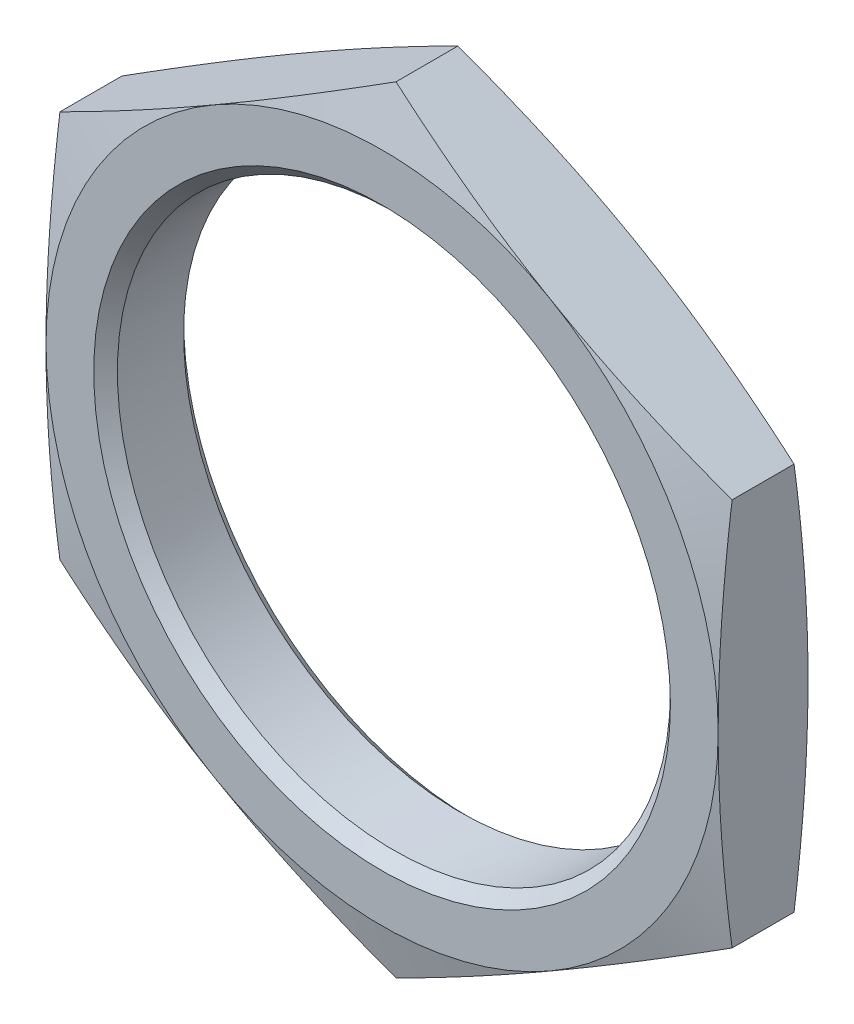
ISO-10303-21;
HEADER;
FILE_DESCRIPTION(('STEP AP214'),'2;1');
FILE_NAME('part.step','',(''),(''),'','','');
FILE_SCHEMA(('AUTOMOTIVE_DESIGN { 1 0 10303 214 1 1 1 1 }'));
ENDSEC;
DATA;
#1=APPLICATION_CONTEXT('core data for automotive mechanical design processes');
#2=APPLICATION_PROTOCOL_DEFINITION('international standard','automotive_design',2000,#1);
#3=PRODUCT_CONTEXT('',#1,'mechanical');
#4=PRODUCT('Part','Part','',(#3));
#5=PRODUCT_RELATED_PRODUCT_CATEGORY('part','',(#4));
#6=PRODUCT_DEFINITION_FORMATION('','',#4);
#7=PRODUCT_DEFINITION_CONTEXT('part definition',#1,'design');
#8=PRODUCT_DEFINITION('design','',#6,#7);
#9=PRODUCT_DEFINITION_SHAPE('','',#8);
#10=(LENGTH_UNIT() NAMED_UNIT(*) SI_UNIT(.MILLI.,.METRE.));
#11=(NAMED_UNIT(*) PLANE_ANGLE_UNIT() SI_UNIT($,.RADIAN.));
#12=(NAMED_UNIT(*) SI_UNIT($,.STERADIAN.) SOLID_ANGLE_UNIT());
#13=UNCERTAINTY_MEASURE_WITH_UNIT(LENGTH_MEASURE(1.E-05),#10,'distance_accuracy_value','');
#14=(GEOMETRIC_REPRESENTATION_CONTEXT(3) GLOBAL_UNCERTAINTY_ASSIGNED_CONTEXT((#13)) GLOBAL_UNIT_ASSIGNED_CONTEXT((#10,
#11,#12)) REPRESENTATION_CONTEXT('',''));
#15=CARTESIAN_POINT('',(0.,0.,0.));
#16=DIRECTION('',(0.,0.,1.));
#17=DIRECTION('',(1.,0.,0.));
#18=AXIS2_PLACEMENT_3D('',#15,#16,#17);
#19=CARTESIAN_POINT('',(0.,0.,-0.95));
#20=DIRECTION('',(0.,0.,-1.));
#21=DIRECTION('',(0.,-1.,0.));
#22=AXIS2_PLACEMENT_3D('',#19,#20,#21);
#23=PLANE('',#22);
#24=CARTESIAN_POINT('',(0.,0.,-0.95));
#25=DIRECTION('',(0.,0.,-1.));
#26=DIRECTION('',(1.,0.,0.));
#27=AXIS2_PLACEMENT_3D('',#24,#25,#26);
#28=CIRCLE('',#27,7.11);
#29=CARTESIAN_POINT('',(7.11,0.,-0.95));
#30=VERTEX_POINT('',#29);
#31=CARTESIAN_POINT('',(3.555,-6.157440620907,-0.95));
#32=VERTEX_POINT('',#31);
#33=EDGE_CURVE('E390',#30,#32,#28,.T.);
#34=ORIENTED_EDGE('',*,*,#33,.T.);
#35=CARTESIAN_POINT('',(0.,0.,-0.95));
#36=DIRECTION('',(0.,0.,-1.));
#37=DIRECTION('',(1.,0.,0.));
#38=AXIS2_PLACEMENT_3D('',#35,#36,#37);
#39=CIRCLE('',#38,7.11);
#40=CARTESIAN_POINT('',(-3.555,-6.157440620907,-0.95));
#41=VERTEX_POINT('',#40);
#42=EDGE_CURVE('E394',#32,#41,#39,.T.);
#43=ORIENTED_EDGE('',*,*,#42,.T.);
#44=CARTESIAN_POINT('',(0.,0.,-0.95));
#45=DIRECTION('',(0.,0.,-1.));
#46=DIRECTION('',(1.,0.,0.));
#47=AXIS2_PLACEMENT_3D('',#44,#45,#46);
#48=CIRCLE('',#47,7.11);
#49=CARTESIAN_POINT('',(-7.11,2.064765472972E-07,-0.95));
#50=VERTEX_POINT('',#49);
#51=EDGE_CURVE('E398',#41,#50,#48,.T.);
#52=ORIENTED_EDGE('',*,*,#51,.T.);
#53=CARTESIAN_POINT('',(0.,0.,-0.95));
#54=DIRECTION('',(0.,0.,-1.));
#55=DIRECTION('',(1.,0.,0.));
#56=AXIS2_PLACEMENT_3D('',#53,#54,#55);
#57=CIRCLE('',#56,7.11);
#58=CARTESIAN_POINT('',(-3.555,6.157440620907,-0.95));
#59=VERTEX_POINT('',#58);
#60=EDGE_CURVE('E25',#50,#59,#57,.T.);
#61=ORIENTED_EDGE('',*,*,#60,.T.);
#62=CARTESIAN_POINT('',(0.,0.,-0.95));
#63=DIRECTION('',(0.,0.,-1.));
#64=DIRECTION('',(1.,0.,0.));
#65=AXIS2_PLACEMENT_3D('',#62,#63,#64);
#66=CIRCLE('',#65,7.11);
#67=CARTESIAN_POINT('',(3.555,6.157440620907,-0.95));
#68=VERTEX_POINT('',#67);
#69=EDGE_CURVE('E11',#59,#68,#66,.T.);
#70=ORIENTED_EDGE('',*,*,#69,.T.);
#71=CARTESIAN_POINT('',(0.,0.,-0.95));
#72=DIRECTION('',(0.,0.,-1.));
#73=DIRECTION('',(1.,0.,0.));
#74=AXIS2_PLACEMENT_3D('',#71,#72,#73);
#75=CIRCLE('',#74,7.11);
#76=EDGE_CURVE('E387',#68,#30,#75,.T.);
#77=ORIENTED_EDGE('',*,*,#76,.T.);
#78=EDGE_LOOP('',(#34,#43,#52,#61,#70,#77));
#79=FACE_BOUND('',#78,.T.);
#80=CARTESIAN_POINT('',(0.,0.,-0.95));
#81=DIRECTION('',(0.,0.,-1.));
#82=DIRECTION('',(1.,0.,0.));
#83=AXIS2_PLACEMENT_3D('',#80,#81,#82);
#84=CIRCLE('',#83,6.1);
#85=CARTESIAN_POINT('',(6.1,0.,-0.95));
#86=VERTEX_POINT('',#85);
#87=EDGE_CURVE('E200',#86,#86,#84,.T.);
#88=ORIENTED_EDGE('',*,*,#87,.F.);
#89=EDGE_LOOP('',(#88));
#90=FACE_BOUND('',#89,.T.);
#91=ADVANCED_FACE('F17',(#79,#90),#23,.T.);
#92=CARTESIAN_POINT('',(0.,0.,0.));
#93=DIRECTION('',(0.,0.,1.));
#94=DIRECTION('',(1.,0.,0.));
#95=AXIS2_PLACEMENT_3D('',#92,#93,#94);
#96=CONICAL_SURFACE('',#95,10.655448267188,1.308996938996);
#97=CARTESIAN_POINT('',(5.95523630408934E-13,8.20992082787682,-0.655277102432029));
#98=CARTESIAN_POINT('',(1.90511875818563,7.10999999999992,-0.95));
#99=CARTESIAN_POINT('',(3.555,6.157440620907,-0.95));
#100=(BOUNDED_CURVE() B_SPLINE_CURVE(2,(#97,#98,#99),.UNSPECIFIED.,.F.,
.F.) B_SPLINE_CURVE_WITH_KNOTS((3,3),(0.,1.),
.UNSPECIFIED.) CURVE() GEOMETRIC_REPRESENTATION_ITEM() RATIONAL_B_SPLINE_CURVE((1.,
1.03795484930204,1.)) REPRESENTATION_ITEM(''));
#101=CARTESIAN_POINT('',(0.,8.209920827876,-0.655277102432));
#102=VERTEX_POINT('',#101);
#103=EDGE_CURVE('E373',#102,#68,#100,.T.);
#104=ORIENTED_EDGE('',*,*,#103,.T.);
#105=ORIENTED_EDGE('',*,*,#69,.F.);
#106=CARTESIAN_POINT('',(-3.555,6.157440620907,-0.95));
#107=CARTESIAN_POINT('',(-1.90511875818559,7.10999999999995,-0.95));
#108=CARTESIAN_POINT('',(-4.72066830070617E-13,8.20992082787689,-0.655277102432009));
#109=(BOUNDED_CURVE() B_SPLINE_CURVE(2,(#106,#107,#108),.UNSPECIFIED.,.F.,
.F.) B_SPLINE_CURVE_WITH_KNOTS((3,3),(0.,1.),
.UNSPECIFIED.) CURVE() GEOMETRIC_REPRESENTATION_ITEM() RATIONAL_B_SPLINE_CURVE((1.,
1.03795484930205,1.)) REPRESENTATION_ITEM(''));
#110=EDGE_CURVE('E315',#59,#102,#109,.T.);
#111=ORIENTED_EDGE('',*,*,#110,.T.);
#112=EDGE_LOOP('',(#104,#105,#111));
#113=FACE_BOUND('',#112,.T.);
#114=ADVANCED_FACE('F414',(#113),#96,.T.);
#115=CARTESIAN_POINT('',(0.,0.,0.));
#116=DIRECTION('',(0.,0.,1.));
#117=DIRECTION('',(1.,0.,0.));
#118=AXIS2_PLACEMENT_3D('',#115,#116,#117);
#119=CONICAL_SURFACE('',#118,10.655448267188,1.308996938996);
#120=CARTESIAN_POINT('',(-7.10999999999942,4.10496041393718,-0.655277102432026));
#121=CARTESIAN_POINT('',(-5.20488124181438,5.20488124181408,-0.950000000000001));
#122=CARTESIAN_POINT('',(-3.555,6.157440620907,-0.95));
#123=(BOUNDED_CURVE() B_SPLINE_CURVE(2,(#120,#121,#122),.UNSPECIFIED.,.F.,
.F.) B_SPLINE_CURVE_WITH_KNOTS((3,3),(0.,1.),
.UNSPECIFIED.) CURVE() GEOMETRIC_REPRESENTATION_ITEM() RATIONAL_B_SPLINE_CURVE((1.,
1.03795484930208,1.)) REPRESENTATION_ITEM(''));
#124=CARTESIAN_POINT('',(-7.11,4.104960413938,-0.655277102432));
#125=VERTEX_POINT('',#124);
#126=EDGE_CURVE('E356',#125,#59,#123,.T.);
#127=ORIENTED_EDGE('',*,*,#126,.T.);
#128=ORIENTED_EDGE('',*,*,#60,.F.);
#129=CARTESIAN_POINT('',(-7.11,2.06476544360344E-07,-0.95));
#130=CARTESIAN_POINT('',(-7.11,1.90511886883588,-0.949999985175651));
#131=CARTESIAN_POINT('',(-7.11,4.10496041393862,-0.655277102432165));
#132=(BOUNDED_CURVE() B_SPLINE_CURVE(2,(#129,#130,#131),.UNSPECIFIED.,.F.,
.F.) B_SPLINE_CURVE_WITH_KNOTS((3,3),(0.,1.),
.UNSPECIFIED.) CURVE() GEOMETRIC_REPRESENTATION_ITEM() RATIONAL_B_SPLINE_CURVE((1.,
1.03795484526372,1.)) REPRESENTATION_ITEM(''));
#133=EDGE_CURVE('E350',#50,#125,#132,.T.);
#134=ORIENTED_EDGE('',*,*,#133,.T.);
#135=EDGE_LOOP('',(#127,#128,#134));
#136=FACE_BOUND('',#135,.T.);
#137=ADVANCED_FACE('F408',(#136),#119,.T.);
#138=CARTESIAN_POINT('',(0.,0.,0.));
#139=DIRECTION('',(0.,0.,1.));
#140=DIRECTION('',(1.,0.,0.));
#141=AXIS2_PLACEMENT_3D('',#138,#139,#140);
#142=CONICAL_SURFACE('',#141,10.655448267188,1.308996938996);
#143=ORIENTED_EDGE('',*,*,#51,.F.);
#144=CARTESIAN_POINT('',(-3.555,-6.157440620907,-0.95));
#145=CARTESIAN_POINT('',(-5.20488124181442,-5.20488124181405,-0.950000000000001));
#146=CARTESIAN_POINT('',(-7.10999999999953,-4.10496041393711,-0.655277102432009));
#147=(BOUNDED_CURVE() B_SPLINE_CURVE(2,(#144,#145,#146),.UNSPECIFIED.,.F.,
.F.) B_SPLINE_CURVE_WITH_KNOTS((3,3),(0.,1.),
.UNSPECIFIED.) CURVE() GEOMETRIC_REPRESENTATION_ITEM() RATIONAL_B_SPLINE_CURVE((1.,
1.03795484930205,1.)) REPRESENTATION_ITEM(''));
#148=CARTESIAN_POINT('',(-7.11,-4.104960413938,-0.655277102432));
#149=VERTEX_POINT('',#148);
#150=EDGE_CURVE('E328',#41,#149,#147,.T.);
#151=ORIENTED_EDGE('',*,*,#150,.T.);
#152=CARTESIAN_POINT('',(-7.11,-4.10496041393616,-0.655277102432491));
#153=CARTESIAN_POINT('',(-7.11,-1.905118647534,-0.950000014824347));
#154=CARTESIAN_POINT('',(-7.11,2.06476544360344E-07,-0.95));
#155=(BOUNDED_CURVE() B_SPLINE_CURVE(2,(#152,#153,#154),.UNSPECIFIED.,.F.,
.F.) B_SPLINE_CURVE_WITH_KNOTS((3,3),(0.,1.),
.UNSPECIFIED.) CURVE() GEOMETRIC_REPRESENTATION_ITEM() RATIONAL_B_SPLINE_CURVE((1.,
1.03795485334035,1.)) REPRESENTATION_ITEM(''));
#156=EDGE_CURVE('E316',#149,#50,#155,.T.);
#157=ORIENTED_EDGE('',*,*,#156,.T.);
#158=EDGE_LOOP('',(#143,#151,#157));
#159=FACE_BOUND('',#158,.T.);
#160=ADVANCED_FACE('F432',(#159),#142,.T.);
#161=CARTESIAN_POINT('',(0.,0.,0.));
#162=DIRECTION('',(0.,0.,1.));
#163=DIRECTION('',(1.,0.,0.));
#164=AXIS2_PLACEMENT_3D('',#161,#162,#163);
#165=CONICAL_SURFACE('',#164,10.655448267188,1.308996938996);
#166=ORIENTED_EDGE('',*,*,#42,.F.);
#167=CARTESIAN_POINT('',(3.555,-6.157440620907,-0.95));
#168=CARTESIAN_POINT('',(1.90511875818559,-7.10999999999995,-0.95));
#169=CARTESIAN_POINT('',(4.73843186910017E-13,-8.20992082787689,-0.655277102432009));
#170=(BOUNDED_CURVE() B_SPLINE_CURVE(2,(#167,#168,#169),.UNSPECIFIED.,.F.,
.F.) B_SPLINE_CURVE_WITH_KNOTS((3,3),(0.,1.),
.UNSPECIFIED.) CURVE() GEOMETRIC_REPRESENTATION_ITEM() RATIONAL_B_SPLINE_CURVE((1.,
1.03795484930205,1.)) REPRESENTATION_ITEM(''));
#171=CARTESIAN_POINT('',(0.,-8.209920827876,-0.655277102432));
#172=VERTEX_POINT('',#171);
#173=EDGE_CURVE('E301',#32,#172,#170,.T.);
#174=ORIENTED_EDGE('',*,*,#173,.T.);
#175=CARTESIAN_POINT('',(-5.87974113841483E-13,-8.20992082787682,-0.655277102432026));
#176=CARTESIAN_POINT('',(-1.90511875818563,-7.10999999999993,-0.950000000000001));
#177=CARTESIAN_POINT('',(-3.555,-6.157440620907,-0.95));
#178=(BOUNDED_CURVE() B_SPLINE_CURVE(2,(#175,#176,#177),.UNSPECIFIED.,.F.,
.F.) B_SPLINE_CURVE_WITH_KNOTS((3,3),(0.,1.),
.UNSPECIFIED.) CURVE() GEOMETRIC_REPRESENTATION_ITEM() RATIONAL_B_SPLINE_CURVE((1.,
1.03795484930208,1.)) REPRESENTATION_ITEM(''));
#179=EDGE_CURVE('E334',#172,#41,#178,.T.);
#180=ORIENTED_EDGE('',*,*,#179,.T.);
#181=EDGE_LOOP('',(#166,#174,#180));
#182=FACE_BOUND('',#181,.T.);
#183=ADVANCED_FACE('F429',(#182),#165,.T.);
#184=CARTESIAN_POINT('',(0.,0.,0.));
#185=DIRECTION('',(0.,0.,1.));
#186=DIRECTION('',(1.,0.,0.));
#187=AXIS2_PLACEMENT_3D('',#184,#185,#186);
#188=CONICAL_SURFACE('',#187,10.655448267188,1.308996938996);
#189=ORIENTED_EDGE('',*,*,#33,.F.);
#190=CARTESIAN_POINT('',(7.11,0.,-0.95));
#191=CARTESIAN_POINT('',(7.11000000000001,-1.90511875818543,-0.95));
#192=CARTESIAN_POINT('',(7.11,-4.10496041393861,-0.655277102432164));
#193=(BOUNDED_CURVE() B_SPLINE_CURVE(2,(#190,#191,#192),.UNSPECIFIED.,.F.,
.F.) B_SPLINE_CURVE_WITH_KNOTS((3,3),(0.,1.),
.UNSPECIFIED.) CURVE() GEOMETRIC_REPRESENTATION_ITEM() RATIONAL_B_SPLINE_CURVE((1.,
1.03795484930205,1.)) REPRESENTATION_ITEM(''));
#194=CARTESIAN_POINT('',(7.11,-4.104960413938,-0.655277102432));
#195=VERTEX_POINT('',#194);
#196=EDGE_CURVE('E277',#30,#195,#193,.T.);
#197=ORIENTED_EDGE('',*,*,#196,.T.);
#198=CARTESIAN_POINT('',(7.10999999999941,-4.10496041393718,-0.655277102432028));
#199=CARTESIAN_POINT('',(5.20488124181437,-5.20488124181408,-0.95));
#200=CARTESIAN_POINT('',(3.555,-6.157440620907,-0.95));
#201=(BOUNDED_CURVE() B_SPLINE_CURVE(2,(#198,#199,#200),.UNSPECIFIED.,.F.,
.F.) B_SPLINE_CURVE_WITH_KNOTS((3,3),(0.,1.),
.UNSPECIFIED.) CURVE() GEOMETRIC_REPRESENTATION_ITEM() RATIONAL_B_SPLINE_CURVE((1.,
1.03795484930206,1.)) REPRESENTATION_ITEM(''));
#202=EDGE_CURVE('E307',#195,#32,#201,.T.);
#203=ORIENTED_EDGE('',*,*,#202,.T.);
#204=EDGE_LOOP('',(#189,#197,#203));
#205=FACE_BOUND('',#204,.T.);
#206=ADVANCED_FACE('F425',(#205),#188,.T.);
#207=CARTESIAN_POINT('',(0.,0.,0.));
#208=DIRECTION('',(0.,0.,1.));
#209=DIRECTION('',(1.,0.,0.));
#210=AXIS2_PLACEMENT_3D('',#207,#208,#209);
#211=CONICAL_SURFACE('',#210,10.655448267188,1.308996938996);
#212=CARTESIAN_POINT('',(7.11,4.10496041393615,-0.655277102432495));
#213=CARTESIAN_POINT('',(7.11000000000001,1.90511875818445,-0.950000000000001));
#214=CARTESIAN_POINT('',(7.11,0.,-0.95));
#215=(BOUNDED_CURVE() B_SPLINE_CURVE(2,(#212,#213,#214),.UNSPECIFIED.,.F.,
.F.) B_SPLINE_CURVE_WITH_KNOTS((3,3),(0.,1.),
.UNSPECIFIED.) CURVE() GEOMETRIC_REPRESENTATION_ITEM() RATIONAL_B_SPLINE_CURVE((1.,
1.03795484930199,1.)) REPRESENTATION_ITEM(''));
#216=CARTESIAN_POINT('',(7.11,4.104960413938,-0.655277102432));
#217=VERTEX_POINT('',#216);
#218=EDGE_CURVE('E283',#217,#30,#215,.T.);
#219=ORIENTED_EDGE('',*,*,#218,.T.);
#220=ORIENTED_EDGE('',*,*,#76,.F.);
#221=CARTESIAN_POINT('',(3.555,6.157440620907,-0.95));
#222=CARTESIAN_POINT('',(5.20488124181442,5.20488124181405,-0.95));
#223=CARTESIAN_POINT('',(7.10999999999953,4.10496041393711,-0.655277102432009));
#224=(BOUNDED_CURVE() B_SPLINE_CURVE(2,(#221,#222,#223),.UNSPECIFIED.,.F.,
.F.) B_SPLINE_CURVE_WITH_KNOTS((3,3),(0.,1.),
.UNSPECIFIED.) CURVE() GEOMETRIC_REPRESENTATION_ITEM() RATIONAL_B_SPLINE_CURVE((1.,
1.03795484930206,1.)) REPRESENTATION_ITEM(''));
#225=EDGE_CURVE('E365',#68,#217,#224,.T.);
#226=ORIENTED_EDGE('',*,*,#225,.T.);
#227=EDGE_LOOP('',(#219,#220,#226));
#228=FACE_BOUND('',#227,.T.);
#229=ADVANCED_FACE('F421',(#228),#211,.T.);
#230=CARTESIAN_POINT('',(0.,0.,-0.7));
#231=DIRECTION('',(0.,0.,-1.));
#232=DIRECTION('',(1.,0.,0.));
#233=AXIS2_PLACEMENT_3D('',#230,#231,#232);
#234=CONICAL_SURFACE('',#233,5.85,0.785398163397);
#235=ORIENTED_EDGE('',*,*,#87,.T.);
#236=DIRECTION('',(0.707106781186548,0.,-0.707106781186548));
#237=VECTOR('',#236,1.);
#238=CARTESIAN_POINT('',(5.85,0.,-0.7));
#239=LINE('',#238,#237);
#240=CARTESIAN_POINT('',(5.85,0.,-0.7));
#241=VERTEX_POINT('',#240);
#242=EDGE_CURVE('E37',#241,#86,#239,.T.);
#243=ORIENTED_EDGE('',*,*,#242,.F.);
#244=CARTESIAN_POINT('',(0.,0.,-0.7));
#245=DIRECTION('',(0.,0.,-1.));
#246=DIRECTION('',(1.,0.,0.));
#247=AXIS2_PLACEMENT_3D('',#244,#245,#246);
#248=CIRCLE('',#247,5.85);
#249=EDGE_CURVE('E272',#241,#241,#248,.T.);
#250=ORIENTED_EDGE('',*,*,#249,.F.);
#251=ORIENTED_EDGE('',*,*,#242,.T.);
#252=EDGE_LOOP('',(#235,#243,#250,#251));
#253=FACE_BOUND('',#252,.T.);
#254=ADVANCED_FACE('F547',(#253),#234,.F.);
#255=CARTESIAN_POINT('',(7.11,4.104960413938,0.95));
#256=DIRECTION('',(0.50000000000019,0.866025403784329,0.));
#257=DIRECTION('',(0.,0.,-1.));
#258=AXIS2_PLACEMENT_3D('',#255,#256,#257);
#259=PLANE('',#258);
#260=CARTESIAN_POINT('',(7.10999999999941,4.10496041393718,0.655277102432028));
#261=CARTESIAN_POINT('',(5.20488124959185,5.20488123732375,0.94999999879682));
#262=CARTESIAN_POINT('',(3.55500001451297,6.15744061252794,0.95));
#263=(BOUNDED_CURVE() B_SPLINE_CURVE(2,(#260,#261,#262),.UNSPECIFIED.,.F.,
.F.) B_SPLINE_CURVE_WITH_KNOTS((3,3),(0.,1.),
.UNSPECIFIED.) CURVE() GEOMETRIC_REPRESENTATION_ITEM() RATIONAL_B_SPLINE_CURVE((1.,
1.03795484897429,1.)) REPRESENTATION_ITEM(''));
#264=CARTESIAN_POINT('',(7.11,4.104960413938,0.655277102432));
#265=VERTEX_POINT('',#264);
#266=CARTESIAN_POINT('',(3.555000014513,6.157440612528,0.95));
#267=VERTEX_POINT('',#266);
#268=EDGE_CURVE('E258',#265,#267,#263,.T.);
#269=ORIENTED_EDGE('',*,*,#268,.F.);
#270=DIRECTION('',(0.,0.,-1.));
#271=VECTOR('',#270,1.);
#272=CARTESIAN_POINT('',(7.11,4.104960413938,0.95));
#273=LINE('',#272,#271);
#274=EDGE_CURVE('E292',#265,#217,#273,.T.);
#275=ORIENTED_EDGE('',*,*,#274,.T.);
#276=ORIENTED_EDGE('',*,*,#225,.F.);
#277=ORIENTED_EDGE('',*,*,#103,.F.);
#278=DIRECTION('',(0.,0.,-1.));
#279=VECTOR('',#278,1.);
#280=CARTESIAN_POINT('',(0.,8.209920827876,0.95));
#281=LINE('',#280,#279);
#282=CARTESIAN_POINT('',(0.,8.209920827876,0.655277102432));
#283=VERTEX_POINT('',#282);
#284=EDGE_CURVE('E308',#283,#102,#281,.T.);
#285=ORIENTED_EDGE('',*,*,#284,.F.);
#286=CARTESIAN_POINT('',(3.55500001451297,6.15744061252794,0.95));
#287=CARTESIAN_POINT('',(1.90511876596306,7.10999999550963,0.95000000120318));
#288=CARTESIAN_POINT('',(4.76063632959267E-13,8.20992082787688,0.655277102432009));
#289=(BOUNDED_CURVE() B_SPLINE_CURVE(2,(#286,#287,#288),.UNSPECIFIED.,.F.,
.F.) B_SPLINE_CURVE_WITH_KNOTS((3,3),(0.,1.),
.UNSPECIFIED.) CURVE() GEOMETRIC_REPRESENTATION_ITEM() RATIONAL_B_SPLINE_CURVE((1.,
1.03795484962984,1.)) REPRESENTATION_ITEM(''));
#290=EDGE_CURVE('E231',#267,#283,#289,.T.);
#291=ORIENTED_EDGE('',*,*,#290,.F.);
#292=EDGE_LOOP('',(#269,#275,#276,#277,#285,#291));
#293=FACE_BOUND('',#292,.T.);
#294=ADVANCED_FACE('F418',(#293),#259,.T.);
#295=CARTESIAN_POINT('',(0.,8.209920827876,0.95));
#296=DIRECTION('',(-0.50000000000019,0.866025403784329,0.));
#297=DIRECTION('',(0.,0.,1.));
#298=AXIS2_PLACEMENT_3D('',#295,#296,#297);
#299=PLANE('',#298);
#300=CARTESIAN_POINT('',(-5.84865489372532E-13,8.20992082787682,0.655277102432026));
#301=CARTESIAN_POINT('',(-1.90511875962655,7.10999999916801,0.950000000222911));
#302=CARTESIAN_POINT('',(-3.55500000268878,6.15744061935463,0.95));
#303=(BOUNDED_CURVE() B_SPLINE_CURVE(2,(#300,#301,#302),.UNSPECIFIED.,.F.,
.F.) B_SPLINE_CURVE_WITH_KNOTS((3,3),(0.,1.),
.UNSPECIFIED.) CURVE() GEOMETRIC_REPRESENTATION_ITEM() RATIONAL_B_SPLINE_CURVE((1.,
1.03795484936277,1.)) REPRESENTATION_ITEM(''));
#304=CARTESIAN_POINT('',(-3.555000002689,6.157440619355,0.95));
#305=VERTEX_POINT('',#304);
#306=EDGE_CURVE('E241',#283,#305,#303,.T.);
#307=ORIENTED_EDGE('',*,*,#306,.F.);
#308=ORIENTED_EDGE('',*,*,#284,.T.);
#309=ORIENTED_EDGE('',*,*,#110,.F.);
#310=ORIENTED_EDGE('',*,*,#126,.F.);
#311=DIRECTION('',(0.,0.,-1.));
#312=VECTOR('',#311,1.);
#313=CARTESIAN_POINT('',(-7.11,4.104960413938,0.95));
#314=LINE('',#313,#312);
#315=CARTESIAN_POINT('',(-7.11,4.104960413938,0.655277102432));
#316=VERTEX_POINT('',#315);
#317=EDGE_CURVE('E343',#316,#125,#314,.T.);
#318=ORIENTED_EDGE('',*,*,#317,.F.);
#319=CARTESIAN_POINT('',(-3.55500000268878,6.15744061935463,0.95));
#320=CARTESIAN_POINT('',(-5.20488124325534,5.20488124098214,0.94999999977709));
#321=CARTESIAN_POINT('',(-7.10999999999953,4.10496041393711,0.655277102432009));
#322=(BOUNDED_CURVE() B_SPLINE_CURVE(2,(#319,#320,#321),.UNSPECIFIED.,.F.,
.F.) B_SPLINE_CURVE_WITH_KNOTS((3,3),(0.,1.),
.UNSPECIFIED.) CURVE() GEOMETRIC_REPRESENTATION_ITEM() RATIONAL_B_SPLINE_CURVE((1.,
1.03795484924133,1.)) REPRESENTATION_ITEM(''));
#323=EDGE_CURVE('E232',#305,#316,#322,.T.);
#324=ORIENTED_EDGE('',*,*,#323,.F.);
#325=EDGE_LOOP('',(#307,#308,#309,#310,#318,#324));
#326=FACE_BOUND('',#325,.T.);
#327=ADVANCED_FACE('F412',(#326),#299,.T.);
#328=CARTESIAN_POINT('',(-7.11,4.104960413938,0.95));
#329=DIRECTION('',(-1.,0.,0.));
#330=DIRECTION('',(0.,0.,1.));
#331=AXIS2_PLACEMENT_3D('',#328,#329,#330);
#332=PLANE('',#331);
#333=CARTESIAN_POINT('',(-7.11,4.10496041393616,0.655277102432492));
#334=CARTESIAN_POINT('',(-7.11,1.90511876550157,0.949999999019693));
#335=CARTESIAN_POINT('',(-7.11,1.36539222868371E-08,0.95));
#336=(BOUNDED_CURVE() B_SPLINE_CURVE(2,(#333,#334,#335),.UNSPECIFIED.,.F.,
.F.) B_SPLINE_CURVE_WITH_KNOTS((3,3),(0.,1.),
.UNSPECIFIED.) CURVE() GEOMETRIC_REPRESENTATION_ITEM() RATIONAL_B_SPLINE_CURVE((1.,
1.03795484903495,1.)) REPRESENTATION_ITEM(''));
#337=CARTESIAN_POINT('',(-7.11,1.365392221937E-08,0.95));
#338=VERTEX_POINT('',#337);
#339=EDGE_CURVE('E223',#316,#338,#336,.T.);
#340=ORIENTED_EDGE('',*,*,#339,.F.);
#341=ORIENTED_EDGE('',*,*,#317,.T.);
#342=ORIENTED_EDGE('',*,*,#133,.F.);
#343=ORIENTED_EDGE('',*,*,#156,.F.);
#344=DIRECTION('',(0.,0.,-1.));
#345=VECTOR('',#344,1.);
#346=CARTESIAN_POINT('',(-7.11,-4.104960413938,0.95));
#347=LINE('',#346,#345);
#348=CARTESIAN_POINT('',(-7.11,-4.104960413938,0.655277102432));
#349=VERTEX_POINT('',#348);
#350=EDGE_CURVE('E322',#349,#149,#347,.T.);
#351=ORIENTED_EDGE('',*,*,#350,.F.);
#352=CARTESIAN_POINT('',(-7.11,1.36539222868371E-08,0.95));
#353=CARTESIAN_POINT('',(-7.11,-1.90511875086832,0.950000000980308));
#354=CARTESIAN_POINT('',(-7.11,-4.10496041393862,0.655277102432165));
#355=(BOUNDED_CURVE() B_SPLINE_CURVE(2,(#352,#353,#354),.UNSPECIFIED.,.F.,
.F.) B_SPLINE_CURVE_WITH_KNOTS((3,3),(0.,1.),
.UNSPECIFIED.) CURVE() GEOMETRIC_REPRESENTATION_ITEM() RATIONAL_B_SPLINE_CURVE((1.,
1.03795484956909,1.)) REPRESENTATION_ITEM(''));
#356=EDGE_CURVE('E159',#338,#349,#355,.T.);
#357=ORIENTED_EDGE('',*,*,#356,.F.);
#358=EDGE_LOOP('',(#340,#341,#342,#343,#351,#357));
#359=FACE_BOUND('',#358,.T.);
#360=ADVANCED_FACE('F437',(#359),#332,.T.);
#361=CARTESIAN_POINT('',(-7.11,-4.104960413938,0.95));
#362=DIRECTION('',(-0.50000000000019,-0.866025403784329,0.));
#363=DIRECTION('',(-0.866025403784329,0.50000000000019,0.));
#364=AXIS2_PLACEMENT_3D('',#361,#362,#363);
#365=PLANE('',#364);
#366=CARTESIAN_POINT('',(-7.10999999999942,-4.10496041393718,0.655277102432026));
#367=CARTESIAN_POINT('',(-5.20488124327462,-5.204881240971,0.949999999774097));
#368=CARTESIAN_POINT('',(-3.55500000272488,-6.15744061933379,0.95));
#369=(BOUNDED_CURVE() B_SPLINE_CURVE(2,(#366,#367,#368),.UNSPECIFIED.,.F.,
.F.) B_SPLINE_CURVE_WITH_KNOTS((3,3),(0.,1.),
.UNSPECIFIED.) CURVE() GEOMETRIC_REPRESENTATION_ITEM() RATIONAL_B_SPLINE_CURVE((1.,
1.03795484924055,1.)) REPRESENTATION_ITEM(''));
#370=CARTESIAN_POINT('',(-3.555000002725,-6.157440619334,0.95));
#371=VERTEX_POINT('',#370);
#372=EDGE_CURVE('E152',#349,#371,#369,.T.);
#373=ORIENTED_EDGE('',*,*,#372,.F.);
#374=ORIENTED_EDGE('',*,*,#350,.T.);
#375=ORIENTED_EDGE('',*,*,#150,.F.);
#376=ORIENTED_EDGE('',*,*,#179,.F.);
#377=DIRECTION('',(0.,0.,-1.));
#378=VECTOR('',#377,1.);
#379=CARTESIAN_POINT('',(0.,-8.209920827876,0.95));
#380=LINE('',#379,#378);
#381=CARTESIAN_POINT('',(0.,-8.209920827876,0.655277102432));
#382=VERTEX_POINT('',#381);
#383=EDGE_CURVE('E169',#382,#172,#380,.T.);
#384=ORIENTED_EDGE('',*,*,#383,.F.);
#385=CARTESIAN_POINT('',(-3.55500000272488,-6.15744061933379,0.95));
#386=CARTESIAN_POINT('',(-1.90511875964584,-7.10999999915686,0.950000000225903));
#387=CARTESIAN_POINT('',(-4.72066830070617E-13,-8.20992082787689,0.655277102432009));
#388=(BOUNDED_CURVE() B_SPLINE_CURVE(2,(#385,#386,#387),.UNSPECIFIED.,.F.,
.F.) B_SPLINE_CURVE_WITH_KNOTS((3,3),(0.,1.),
.UNSPECIFIED.) CURVE() GEOMETRIC_REPRESENTATION_ITEM() RATIONAL_B_SPLINE_CURVE((1.,
1.0379548493636,1.)) REPRESENTATION_ITEM(''));
#389=EDGE_CURVE('E163',#371,#382,#388,.T.);
#390=ORIENTED_EDGE('',*,*,#389,.F.);
#391=EDGE_LOOP('',(#373,#374,#375,#376,#384,#390));
#392=FACE_BOUND('',#391,.T.);
#393=ADVANCED_FACE('F167',(#392),#365,.T.);
#394=CARTESIAN_POINT('',(0.,-8.209920827876,0.95));
#395=DIRECTION('',(0.50000000000019,-0.866025403784329,0.));
#396=DIRECTION('',(0.,0.,-1.));
#397=AXIS2_PLACEMENT_3D('',#394,#395,#396);
#398=PLANE('',#397);
#399=CARTESIAN_POINT('',(5.92859095149834E-13,-8.20992082787682,0.655277102432028));
#400=CARTESIAN_POINT('',(1.90511875870171,-7.10999999970198,0.950000000079838));
#401=CARTESIAN_POINT('',(3.555000000963,-6.15744062035101,0.95));
#402=(BOUNDED_CURVE() B_SPLINE_CURVE(2,(#399,#400,#401),.UNSPECIFIED.,.F.,
.F.) B_SPLINE_CURVE_WITH_KNOTS((3,3),(0.,1.),
.UNSPECIFIED.) CURVE() GEOMETRIC_REPRESENTATION_ITEM() RATIONAL_B_SPLINE_CURVE((1.,
1.03795484932379,1.)) REPRESENTATION_ITEM(''));
#403=CARTESIAN_POINT('',(3.555000000963,-6.157440620351,0.95));
#404=VERTEX_POINT('',#403);
#405=EDGE_CURVE('E173',#382,#404,#402,.T.);
#406=ORIENTED_EDGE('',*,*,#405,.F.);
#407=ORIENTED_EDGE('',*,*,#383,.T.);
#408=ORIENTED_EDGE('',*,*,#173,.F.);
#409=ORIENTED_EDGE('',*,*,#202,.F.);
#410=DIRECTION('',(0.,0.,-1.));
#411=VECTOR('',#410,1.);
#412=CARTESIAN_POINT('',(7.11,-4.104960413938,0.95));
#413=LINE('',#412,#411);
#414=CARTESIAN_POINT('',(7.11,-4.104960413938,0.655277102432));
#415=VERTEX_POINT('',#414);
#416=EDGE_CURVE('E273',#415,#195,#413,.T.);
#417=ORIENTED_EDGE('',*,*,#416,.F.);
#418=CARTESIAN_POINT('',(3.555000000963,-6.15744062035101,0.95));
#419=CARTESIAN_POINT('',(5.20488124233049,-5.2048812415161,0.949999999920163));
#420=CARTESIAN_POINT('',(7.10999999999953,-4.10496041393711,0.655277102432009));
#421=(BOUNDED_CURVE() B_SPLINE_CURVE(2,(#418,#419,#420),.UNSPECIFIED.,.F.,
.F.) B_SPLINE_CURVE_WITH_KNOTS((3,3),(0.,1.),
.UNSPECIFIED.) CURVE() GEOMETRIC_REPRESENTATION_ITEM() RATIONAL_B_SPLINE_CURVE((1.,
1.03795484928034,1.)) REPRESENTATION_ITEM(''));
#422=EDGE_CURVE('E211',#404,#415,#421,.T.);
#423=ORIENTED_EDGE('',*,*,#422,.F.);
#424=EDGE_LOOP('',(#406,#407,#408,#409,#417,#423));
#425=FACE_BOUND('',#424,.T.);
#426=ADVANCED_FACE('F427',(#425),#398,.T.);
#427=CARTESIAN_POINT('',(7.11,-4.104960413938,0.95));
#428=DIRECTION('',(1.,0.,0.));
#429=DIRECTION('',(0.,1.,0.));
#430=AXIS2_PLACEMENT_3D('',#427,#428,#429);
#431=PLANE('',#430);
#432=CARTESIAN_POINT('',(7.11,-4.10496041393615,0.655277102432494));
#433=CARTESIAN_POINT('',(7.11000000000001,-1.90511875818445,0.950000000000002));
#434=CARTESIAN_POINT('',(7.11,0.,0.95));
#435=(BOUNDED_CURVE() B_SPLINE_CURVE(2,(#432,#433,#434),.UNSPECIFIED.,.F.,
.F.) B_SPLINE_CURVE_WITH_KNOTS((3,3),(0.,1.),
.UNSPECIFIED.) CURVE() GEOMETRIC_REPRESENTATION_ITEM() RATIONAL_B_SPLINE_CURVE((1.,
1.03795484930201,1.)) REPRESENTATION_ITEM(''));
#436=CARTESIAN_POINT('',(7.11,0.,0.95));
#437=VERTEX_POINT('',#436);
#438=EDGE_CURVE('E207',#415,#437,#435,.T.);
#439=ORIENTED_EDGE('',*,*,#438,.F.);
#440=ORIENTED_EDGE('',*,*,#416,.T.);
#441=ORIENTED_EDGE('',*,*,#196,.F.);
#442=ORIENTED_EDGE('',*,*,#218,.F.);
#443=ORIENTED_EDGE('',*,*,#274,.F.);
#444=CARTESIAN_POINT('',(7.11,0.,0.95));
#445=CARTESIAN_POINT('',(7.11,1.90511875818543,0.949999999999999));
#446=CARTESIAN_POINT('',(7.11,4.10496041393861,0.655277102432164));
#447=(BOUNDED_CURVE() B_SPLINE_CURVE(2,(#444,#445,#446),.UNSPECIFIED.,.F.,
.F.) B_SPLINE_CURVE_WITH_KNOTS((3,3),(0.,1.),
.UNSPECIFIED.) CURVE() GEOMETRIC_REPRESENTATION_ITEM() RATIONAL_B_SPLINE_CURVE((1.,
1.03795484930205,1.)) REPRESENTATION_ITEM(''));
#448=EDGE_CURVE('E249',#437,#265,#447,.T.);
#449=ORIENTED_EDGE('',*,*,#448,.F.);
#450=EDGE_LOOP('',(#439,#440,#441,#442,#443,#449));
#451=FACE_BOUND('',#450,.T.);
#452=ADVANCED_FACE('F483',(#451),#431,.T.);
#453=CARTESIAN_POINT('',(0.,0.,-0.95));
#454=DIRECTION('',(0.,0.,1.));
#455=DIRECTION('',(1.,0.,0.));
#456=AXIS2_PLACEMENT_3D('',#453,#454,#455);
#457=CYLINDRICAL_SURFACE('',#456,5.85);
#458=DIRECTION('',(0.,0.,1.));
#459=VECTOR('',#458,1.);
#460=CARTESIAN_POINT('',(5.85,0.,-0.95));
#461=LINE('',#460,#459);
#462=CARTESIAN_POINT('',(5.85,0.,0.7));
#463=VERTEX_POINT('',#462);
#464=EDGE_CURVE('E266',#241,#463,#461,.T.);
#465=ORIENTED_EDGE('',*,*,#464,.F.);
#466=ORIENTED_EDGE('',*,*,#249,.T.);
#467=ORIENTED_EDGE('',*,*,#464,.T.);
#468=CARTESIAN_POINT('',(0.,0.,0.7));
#469=DIRECTION('',(0.,0.,-1.));
#470=DIRECTION('',(1.,0.,0.));
#471=AXIS2_PLACEMENT_3D('',#468,#469,#470);
#472=CIRCLE('',#471,5.85);
#473=EDGE_CURVE('E183',#463,#463,#472,.T.);
#474=ORIENTED_EDGE('',*,*,#473,.F.);
#475=EDGE_LOOP('',(#465,#466,#467,#474));
#476=FACE_BOUND('',#475,.T.);
#477=ADVANCED_FACE('F526',(#476),#457,.F.);
#478=CARTESIAN_POINT('',(0.,0.,0.95));
#479=DIRECTION('',(0.,0.,-1.));
#480=DIRECTION('',(1.,0.,0.));
#481=AXIS2_PLACEMENT_3D('',#478,#479,#480);
#482=CONICAL_SURFACE('',#481,7.11,1.308996938996);
#483=CARTESIAN_POINT('',(0.,0.,0.95));
#484=DIRECTION('',(0.,0.,-1.));
#485=DIRECTION('',(1.,0.,0.));
#486=AXIS2_PLACEMENT_3D('',#483,#484,#485);
#487=CIRCLE('',#486,7.11);
#488=EDGE_CURVE('E455',#267,#437,#487,.T.);
#489=ORIENTED_EDGE('',*,*,#488,.T.);
#490=ORIENTED_EDGE('',*,*,#448,.T.);
#491=ORIENTED_EDGE('',*,*,#268,.T.);
#492=EDGE_LOOP('',(#489,#490,#491));
#493=FACE_BOUND('',#492,.T.);
#494=ADVANCED_FACE('F485',(#493),#482,.T.);
#495=CARTESIAN_POINT('',(0.,0.,0.95));
#496=DIRECTION('',(0.,0.,-1.));
#497=DIRECTION('',(1.,0.,0.));
#498=AXIS2_PLACEMENT_3D('',#495,#496,#497);
#499=CONICAL_SURFACE('',#498,7.11,1.308996938996);
#500=CARTESIAN_POINT('',(0.,0.,0.95));
#501=DIRECTION('',(0.,0.,-1.));
#502=DIRECTION('',(1.,0.,0.));
#503=AXIS2_PLACEMENT_3D('',#500,#501,#502);
#504=CIRCLE('',#503,7.11);
#505=EDGE_CURVE('E196',#305,#267,#504,.T.);
#506=ORIENTED_EDGE('',*,*,#505,.T.);
#507=ORIENTED_EDGE('',*,*,#290,.T.);
#508=ORIENTED_EDGE('',*,*,#306,.T.);
#509=EDGE_LOOP('',(#506,#507,#508));
#510=FACE_BOUND('',#509,.T.);
#511=ADVANCED_FACE('F517',(#510),#499,.T.);
#512=CARTESIAN_POINT('',(0.,0.,0.95));
#513=DIRECTION('',(0.,0.,-1.));
#514=DIRECTION('',(1.,0.,0.));
#515=AXIS2_PLACEMENT_3D('',#512,#513,#514);
#516=CONICAL_SURFACE('',#515,7.11,1.308996938996);
#517=CARTESIAN_POINT('',(0.,0.,0.95));
#518=DIRECTION('',(0.,0.,-1.));
#519=DIRECTION('',(1.,0.,0.));
#520=AXIS2_PLACEMENT_3D('',#517,#518,#519);
#521=CIRCLE('',#520,7.11);
#522=EDGE_CURVE('E189',#338,#305,#521,.T.);
#523=ORIENTED_EDGE('',*,*,#522,.T.);
#524=ORIENTED_EDGE('',*,*,#323,.T.);
#525=ORIENTED_EDGE('',*,*,#339,.T.);
#526=EDGE_LOOP('',(#523,#524,#525));
#527=FACE_BOUND('',#526,.T.);
#528=ADVANCED_FACE('F515',(#527),#516,.T.);
#529=CARTESIAN_POINT('',(0.,0.,0.95));
#530=DIRECTION('',(0.,0.,-1.));
#531=DIRECTION('',(1.,0.,0.));
#532=AXIS2_PLACEMENT_3D('',#529,#530,#531);
#533=CONICAL_SURFACE('',#532,7.11,1.308996938996);
#534=ORIENTED_EDGE('',*,*,#372,.T.);
#535=CARTESIAN_POINT('',(0.,0.,0.95));
#536=DIRECTION('',(0.,0.,-1.));
#537=DIRECTION('',(1.,0.,0.));
#538=AXIS2_PLACEMENT_3D('',#535,#536,#537);
#539=CIRCLE('',#538,7.11);
#540=EDGE_CURVE('E156',#371,#338,#539,.T.);
#541=ORIENTED_EDGE('',*,*,#540,.T.);
#542=ORIENTED_EDGE('',*,*,#356,.T.);
#543=EDGE_LOOP('',(#534,#541,#542));
#544=FACE_BOUND('',#543,.T.);
#545=ADVANCED_FACE('F154',(#544),#533,.T.);
#546=CARTESIAN_POINT('',(0.,0.,0.95));
#547=DIRECTION('',(0.,0.,-1.));
#548=DIRECTION('',(1.,0.,0.));
#549=AXIS2_PLACEMENT_3D('',#546,#547,#548);
#550=CONICAL_SURFACE('',#549,7.11,1.308996938996);
#551=ORIENTED_EDGE('',*,*,#405,.T.);
#552=CARTESIAN_POINT('',(0.,0.,0.95));
#553=DIRECTION('',(0.,0.,-1.));
#554=DIRECTION('',(1.,0.,0.));
#555=AXIS2_PLACEMENT_3D('',#552,#553,#554);
#556=CIRCLE('',#555,7.11);
#557=EDGE_CURVE('E176',#404,#371,#556,.T.);
#558=ORIENTED_EDGE('',*,*,#557,.T.);
#559=ORIENTED_EDGE('',*,*,#389,.T.);
#560=EDGE_LOOP('',(#551,#558,#559));
#561=FACE_BOUND('',#560,.T.);
#562=ADVANCED_FACE('F177',(#561),#550,.T.);
#563=CARTESIAN_POINT('',(0.,0.,0.95));
#564=DIRECTION('',(0.,0.,-1.));
#565=DIRECTION('',(1.,0.,0.));
#566=AXIS2_PLACEMENT_3D('',#563,#564,#565);
#567=CONICAL_SURFACE('',#566,7.11,1.308996938996);
#568=ORIENTED_EDGE('',*,*,#438,.T.);
#569=CARTESIAN_POINT('',(0.,0.,0.95));
#570=DIRECTION('',(0.,0.,-1.));
#571=DIRECTION('',(1.,0.,0.));
#572=AXIS2_PLACEMENT_3D('',#569,#570,#571);
#573=CIRCLE('',#572,7.11);
#574=EDGE_CURVE('E459',#437,#404,#573,.T.);
#575=ORIENTED_EDGE('',*,*,#574,.T.);
#576=ORIENTED_EDGE('',*,*,#422,.T.);
#577=EDGE_LOOP('',(#568,#575,#576));
#578=FACE_BOUND('',#577,.T.);
#579=ADVANCED_FACE('F481',(#578),#567,.T.);
#580=CARTESIAN_POINT('',(0.,0.,0.7));
#581=DIRECTION('',(0.,0.,1.));
#582=DIRECTION('',(1.,0.,0.));
#583=AXIS2_PLACEMENT_3D('',#580,#581,#582);
#584=CONICAL_SURFACE('',#583,5.85,0.785398163397);
#585=ORIENTED_EDGE('',*,*,#473,.T.);
#586=DIRECTION('',(-0.707106781186548,0.,-0.707106781186548));
#587=VECTOR('',#586,1.);
#588=CARTESIAN_POINT('',(5.85,0.,0.7));
#589=LINE('',#588,#587);
#590=CARTESIAN_POINT('',(6.1,0.,0.95));
#591=VERTEX_POINT('',#590);
#592=EDGE_CURVE('E202',#591,#463,#589,.T.);
#593=ORIENTED_EDGE('',*,*,#592,.F.);
#594=CARTESIAN_POINT('',(0.,0.,0.95));
#595=DIRECTION('',(0.,0.,-1.));
#596=DIRECTION('',(1.,0.,0.));
#597=AXIS2_PLACEMENT_3D('',#594,#595,#596);
#598=CIRCLE('',#597,6.1);
#599=EDGE_CURVE('E489',#591,#591,#598,.T.);
#600=ORIENTED_EDGE('',*,*,#599,.F.);
#601=ORIENTED_EDGE('',*,*,#592,.T.);
#602=EDGE_LOOP('',(#585,#593,#600,#601));
#603=FACE_BOUND('',#602,.T.);
#604=ADVANCED_FACE('F569',(#603),#584,.F.);
#605=CARTESIAN_POINT('',(0.,0.,0.95));
#606=DIRECTION('',(0.,0.,-1.));
#607=DIRECTION('',(0.,-1.,0.));
#608=AXIS2_PLACEMENT_3D('',#605,#606,#607);
#609=PLANE('',#608);
#610=ORIENTED_EDGE('',*,*,#574,.F.);
#611=ORIENTED_EDGE('',*,*,#488,.F.);
#612=ORIENTED_EDGE('',*,*,#505,.F.);
#613=ORIENTED_EDGE('',*,*,#522,.F.);
#614=ORIENTED_EDGE('',*,*,#540,.F.);
#615=ORIENTED_EDGE('',*,*,#557,.F.);
#616=EDGE_LOOP('',(#610,#611,#612,#613,#614,#615));
#617=FACE_BOUND('',#616,.T.);
#618=ORIENTED_EDGE('',*,*,#599,.T.);
#619=EDGE_LOOP('',(#618));
#620=FACE_BOUND('',#619,.T.);
#621=ADVANCED_FACE('F185',(#617,#620),#609,.F.);
#622=CLOSED_SHELL('',(#91,#114,#137,#160,#183,#206,#229,#254,#294,#327,#360,#393,#426,#452,#477,
#494,#511,#528,#545,#562,#579,#604,#621));
#623=MANIFOLD_SOLID_BREP('B1',#622);
#624=ADVANCED_BREP_SHAPE_REPRESENTATION('',(#18,#623),#14);
#625=SHAPE_DEFINITION_REPRESENTATION(#9,#624);
ENDSEC;
END-ISO-10303-21;
